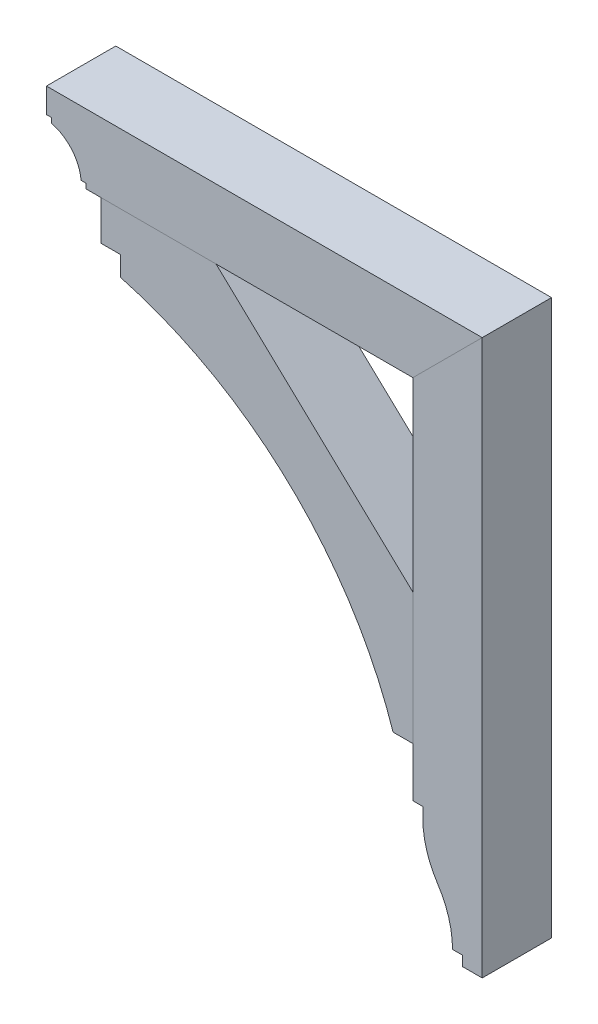
ISO-10303-21;
HEADER;
FILE_DESCRIPTION(('STEP AP214'),'2;1');
FILE_NAME('part.step','',(''),(''),'','','');
FILE_SCHEMA(('AUTOMOTIVE_DESIGN { 1 0 10303 214 1 1 1 1 }'));
ENDSEC;
DATA;
#1=APPLICATION_CONTEXT('core data for automotive mechanical design processes');
#2=APPLICATION_PROTOCOL_DEFINITION('international standard','automotive_design',2000,#1);
#3=PRODUCT_CONTEXT('',#1,'mechanical');
#4=PRODUCT('Part','Part','',(#3));
#5=PRODUCT_RELATED_PRODUCT_CATEGORY('part','',(#4));
#6=PRODUCT_DEFINITION_FORMATION('','',#4);
#7=PRODUCT_DEFINITION_CONTEXT('part definition',#1,'design');
#8=PRODUCT_DEFINITION('design','',#6,#7);
#9=PRODUCT_DEFINITION_SHAPE('','',#8);
#10=(LENGTH_UNIT() NAMED_UNIT(*) SI_UNIT(.MILLI.,.METRE.));
#11=(NAMED_UNIT(*) PLANE_ANGLE_UNIT() SI_UNIT($,.RADIAN.));
#12=(NAMED_UNIT(*) SI_UNIT($,.STERADIAN.) SOLID_ANGLE_UNIT());
#13=UNCERTAINTY_MEASURE_WITH_UNIT(LENGTH_MEASURE(1.E-05),#10,'distance_accuracy_value','');
#14=(GEOMETRIC_REPRESENTATION_CONTEXT(3) GLOBAL_UNCERTAINTY_ASSIGNED_CONTEXT((#13)) GLOBAL_UNIT_ASSIGNED_CONTEXT((#10,
#11,#12)) REPRESENTATION_CONTEXT('',''));
#15=CARTESIAN_POINT('',(0.,0.,0.));
#16=DIRECTION('',(0.,0.,1.));
#17=DIRECTION('',(1.,0.,0.));
#18=AXIS2_PLACEMENT_3D('',#15,#16,#17);
#19=CARTESIAN_POINT('',(246.881223015558,-2.15821431605898E-12,44.45));
#20=DIRECTION('',(1.,0.,0.));
#21=DIRECTION('',(0.,1.,0.));
#22=AXIS2_PLACEMENT_3D('',#19,#20,#21);
#23=PLANE('',#22);
#24=DIRECTION('',(0.,-1.,0.));
#25=VECTOR('',#24,1.);
#26=CARTESIAN_POINT('',(246.881223015558,-2.15821431605898E-12,-44.45));
#27=LINE('',#26,#25);
#28=CARTESIAN_POINT('',(246.881223015556,-183.515,-44.45));
#29=VERTEX_POINT('',#28);
#30=CARTESIAN_POINT('',(246.881223015556,-196.215,-44.45));
#31=VERTEX_POINT('',#30);
#32=EDGE_CURVE('E177',#29,#31,#27,.T.);
#33=ORIENTED_EDGE('',*,*,#32,.T.);
#34=DIRECTION('',(0.,0.,-1.));
#35=VECTOR('',#34,1.);
#36=CARTESIAN_POINT('',(246.881223015556,-196.215,44.45));
#37=LINE('',#36,#35);
#38=CARTESIAN_POINT('',(246.881223015556,-196.215,44.45));
#39=VERTEX_POINT('',#38);
#40=EDGE_CURVE('E12',#39,#31,#37,.T.);
#41=ORIENTED_EDGE('',*,*,#40,.F.);
#42=DIRECTION('',(0.,-1.,0.));
#43=VECTOR('',#42,1.);
#44=CARTESIAN_POINT('',(246.881223015558,-2.15821431605898E-12,44.45));
#45=LINE('',#44,#43);
#46=CARTESIAN_POINT('',(246.881223015556,-183.515,44.45));
#47=VERTEX_POINT('',#46);
#48=EDGE_CURVE('E209',#47,#39,#45,.T.);
#49=ORIENTED_EDGE('',*,*,#48,.F.);
#50=DIRECTION('',(0.,0.,-1.));
#51=VECTOR('',#50,1.);
#52=CARTESIAN_POINT('',(246.881223015556,-183.515,44.45));
#53=LINE('',#52,#51);
#54=EDGE_CURVE('E173',#47,#29,#53,.T.);
#55=ORIENTED_EDGE('',*,*,#54,.T.);
#56=EDGE_LOOP('',(#33,#41,#49,#55));
#57=FACE_BOUND('',#56,.T.);
#58=ADVANCED_FACE('F60',(#57),#23,.F.);
#59=CARTESIAN_POINT('',(362.768723015556,-196.215,44.45));
#60=DIRECTION('',(0.,0.,-1.));
#61=DIRECTION('',(-1.,0.,0.));
#62=AXIS2_PLACEMENT_3D('',#59,#60,#61);
#63=CYLINDRICAL_SURFACE('',#62,115.8875);
#64=CARTESIAN_POINT('',(362.768723015556,-196.215,-44.45));
#65=DIRECTION('',(0.,0.,1.));
#66=DIRECTION('',(1.,0.,0.));
#67=AXIS2_PLACEMENT_3D('',#64,#65,#66);
#68=CIRCLE('',#67,115.8875);
#69=CARTESIAN_POINT('',(266.018608336656,-260.006284403669,-44.45));
#70=VERTEX_POINT('',#69);
#71=EDGE_CURVE('E181',#31,#70,#68,.T.);
#72=ORIENTED_EDGE('',*,*,#71,.T.);
#73=DIRECTION('',(0.,0.,-1.));
#74=VECTOR('',#73,1.);
#75=CARTESIAN_POINT('',(266.018608336656,-260.006284403669,44.45));
#76=LINE('',#75,#74);
#77=CARTESIAN_POINT('',(266.018608336656,-260.006284403669,44.45));
#78=VERTEX_POINT('',#77);
#79=EDGE_CURVE('E69',#78,#70,#76,.T.);
#80=ORIENTED_EDGE('',*,*,#79,.F.);
#81=CARTESIAN_POINT('',(362.768723015556,-196.215,44.45));
#82=DIRECTION('',(0.,0.,1.));
#83=DIRECTION('',(1.,0.,0.));
#84=AXIS2_PLACEMENT_3D('',#81,#82,#83);
#85=CIRCLE('',#84,115.8875);
#86=EDGE_CURVE('E126',#39,#78,#85,.T.);
#87=ORIENTED_EDGE('',*,*,#86,.F.);
#88=ORIENTED_EDGE('',*,*,#40,.T.);
#89=EDGE_LOOP('',(#72,#80,#87,#88));
#90=FACE_BOUND('',#89,.T.);
#91=ADVANCED_FACE('F234',(#90),#63,.T.);
#92=CARTESIAN_POINT('',(170.152056348885,-323.215,44.45));
#93=DIRECTION('',(0.,0.,-1.));
#94=DIRECTION('',(-1.,0.,0.));
#95=AXIS2_PLACEMENT_3D('',#92,#93,#94);
#96=CYLINDRICAL_SURFACE('',#95,114.82916666667);
#97=CARTESIAN_POINT('',(170.152056348885,-323.215,-44.45));
#98=DIRECTION('',(0.,0.,1.));
#99=DIRECTION('',(1.,0.,0.));
#100=AXIS2_PLACEMENT_3D('',#97,#98,#99);
#101=CIRCLE('',#100,114.82916666667);
#102=CARTESIAN_POINT('',(284.981223015555,-323.215,-44.45));
#103=VERTEX_POINT('',#102);
#104=EDGE_CURVE('E185',#103,#70,#101,.T.);
#105=ORIENTED_EDGE('',*,*,#104,.F.);
#106=DIRECTION('',(0.,0.,-1.));
#107=VECTOR('',#106,1.);
#108=CARTESIAN_POINT('',(284.981223015555,-323.215,44.45));
#109=LINE('',#108,#107);
#110=CARTESIAN_POINT('',(284.981223015555,-323.215,44.45));
#111=VERTEX_POINT('',#110);
#112=EDGE_CURVE('E225',#111,#103,#109,.T.);
#113=ORIENTED_EDGE('',*,*,#112,.F.);
#114=CARTESIAN_POINT('',(170.152056348885,-323.215,44.45));
#115=DIRECTION('',(0.,0.,1.));
#116=DIRECTION('',(1.,0.,0.));
#117=AXIS2_PLACEMENT_3D('',#114,#115,#116);
#118=CIRCLE('',#117,114.82916666667);
#119=EDGE_CURVE('E233',#111,#78,#118,.T.);
#120=ORIENTED_EDGE('',*,*,#119,.T.);
#121=ORIENTED_EDGE('',*,*,#79,.T.);
#122=EDGE_LOOP('',(#105,#113,#120,#121));
#123=FACE_BOUND('',#122,.T.);
#124=ADVANCED_FACE('F231',(#123),#96,.F.);
#125=CARTESIAN_POINT('',(0.,-323.215,44.45));
#126=DIRECTION('',(0.,-1.,0.));
#127=DIRECTION('',(0.,0.,-1.));
#128=AXIS2_PLACEMENT_3D('',#125,#126,#127);
#129=PLANE('',#128);
#130=DIRECTION('',(-1.,0.,0.));
#131=VECTOR('',#130,1.);
#132=CARTESIAN_POINT('',(0.,-323.215,-44.45));
#133=LINE('',#132,#131);
#134=CARTESIAN_POINT('',(297.681223015555,-323.215,-44.45));
#135=VERTEX_POINT('',#134);
#136=EDGE_CURVE('E189',#135,#103,#133,.T.);
#137=ORIENTED_EDGE('',*,*,#136,.F.);
#138=DIRECTION('',(0.,0.,-1.));
#139=VECTOR('',#138,1.);
#140=CARTESIAN_POINT('',(297.681223015555,-323.215,44.45));
#141=LINE('',#140,#139);
#142=CARTESIAN_POINT('',(297.681223015555,-323.215,44.45));
#143=VERTEX_POINT('',#142);
#144=EDGE_CURVE('E222',#143,#135,#141,.T.);
#145=ORIENTED_EDGE('',*,*,#144,.F.);
#146=DIRECTION('',(-1.,0.,0.));
#147=VECTOR('',#146,1.);
#148=CARTESIAN_POINT('',(0.,-323.215,44.45));
#149=LINE('',#148,#147);
#150=EDGE_CURVE('E245',#143,#111,#149,.T.);
#151=ORIENTED_EDGE('',*,*,#150,.T.);
#152=ORIENTED_EDGE('',*,*,#112,.T.);
#153=EDGE_LOOP('',(#137,#145,#151,#152));
#154=FACE_BOUND('',#153,.T.);
#155=ADVANCED_FACE('F242',(#154),#129,.T.);
#156=CARTESIAN_POINT('',(297.681223015555,0.,44.45));
#157=DIRECTION('',(-1.,0.,0.));
#158=DIRECTION('',(0.,0.,1.));
#159=AXIS2_PLACEMENT_3D('',#156,#157,#158);
#160=PLANE('',#159);
#161=DIRECTION('',(0.,1.,0.));
#162=VECTOR('',#161,1.);
#163=CARTESIAN_POINT('',(297.681223015555,0.,-44.45));
#164=LINE('',#163,#162);
#165=CARTESIAN_POINT('',(297.681223015555,-335.915,-44.45));
#166=VERTEX_POINT('',#165);
#167=EDGE_CURVE('E193',#166,#135,#164,.T.);
#168=ORIENTED_EDGE('',*,*,#167,.F.);
#169=DIRECTION('',(0.,0.,-1.));
#170=VECTOR('',#169,1.);
#171=CARTESIAN_POINT('',(297.681223015555,-335.915,44.45));
#172=LINE('',#171,#170);
#173=CARTESIAN_POINT('',(297.681223015555,-335.915,44.45));
#174=VERTEX_POINT('',#173);
#175=EDGE_CURVE('E219',#174,#166,#172,.T.);
#176=ORIENTED_EDGE('',*,*,#175,.F.);
#177=DIRECTION('',(0.,1.,0.));
#178=VECTOR('',#177,1.);
#179=CARTESIAN_POINT('',(297.681223015555,0.,44.45));
#180=LINE('',#179,#178);
#181=EDGE_CURVE('E253',#174,#143,#180,.T.);
#182=ORIENTED_EDGE('',*,*,#181,.T.);
#183=ORIENTED_EDGE('',*,*,#144,.T.);
#184=EDGE_LOOP('',(#168,#176,#182,#183));
#185=FACE_BOUND('',#184,.T.);
#186=ADVANCED_FACE('F300',(#185),#160,.T.);
#187=CARTESIAN_POINT('',(7.34134975033387E-13,-335.915000000001,44.45));
#188=DIRECTION('',(0.,-1.,0.));
#189=DIRECTION('',(1.,0.,0.));
#190=AXIS2_PLACEMENT_3D('',#187,#188,#189);
#191=PLANE('',#190);
#192=DIRECTION('',(-1.,0.,0.));
#193=VECTOR('',#192,1.);
#194=CARTESIAN_POINT('',(7.34134975033387E-13,-335.915000000001,-44.45));
#195=LINE('',#194,#193);
#196=CARTESIAN_POINT('',(323.081223015555,-335.915,-44.45));
#197=VERTEX_POINT('',#196);
#198=EDGE_CURVE('E197',#197,#166,#195,.T.);
#199=ORIENTED_EDGE('',*,*,#198,.F.);
#200=DIRECTION('',(0.,0.,-1.));
#201=VECTOR('',#200,1.);
#202=CARTESIAN_POINT('',(323.081223015555,-335.915,44.45));
#203=LINE('',#202,#201);
#204=CARTESIAN_POINT('',(323.081223015555,-335.915,44.45));
#205=VERTEX_POINT('',#204);
#206=EDGE_CURVE('E216',#205,#197,#203,.T.);
#207=ORIENTED_EDGE('',*,*,#206,.F.);
#208=DIRECTION('',(-1.,0.,0.));
#209=VECTOR('',#208,1.);
#210=CARTESIAN_POINT('',(7.34134975033387E-13,-335.915000000001,44.45));
#211=LINE('',#210,#209);
#212=EDGE_CURVE('E261',#205,#174,#211,.T.);
#213=ORIENTED_EDGE('',*,*,#212,.T.);
#214=ORIENTED_EDGE('',*,*,#175,.T.);
#215=EDGE_LOOP('',(#199,#207,#213,#214));
#216=FACE_BOUND('',#215,.T.);
#217=ADVANCED_FACE('F298',(#216),#191,.T.);
#218=CARTESIAN_POINT('',(323.081223015555,0.,44.45));
#219=DIRECTION('',(-1.,0.,0.));
#220=DIRECTION('',(0.,0.,1.));
#221=AXIS2_PLACEMENT_3D('',#218,#219,#220);
#222=PLANE('',#221);
#223=DIRECTION('',(0.,1.,0.));
#224=VECTOR('',#223,1.);
#225=CARTESIAN_POINT('',(323.081223015555,0.,-44.45));
#226=LINE('',#225,#224);
#227=CARTESIAN_POINT('',(323.081223015555,375.285,-44.45));
#228=VERTEX_POINT('',#227);
#229=EDGE_CURVE('E201',#197,#228,#226,.T.);
#230=ORIENTED_EDGE('',*,*,#229,.T.);
#231=DIRECTION('',(0.,0.,-1.));
#232=VECTOR('',#231,1.);
#233=CARTESIAN_POINT('',(323.081223015555,375.285,44.45));
#234=LINE('',#233,#232);
#235=CARTESIAN_POINT('',(323.081223015555,375.285,44.45));
#236=VERTEX_POINT('',#235);
#237=EDGE_CURVE('E163',#236,#228,#234,.T.);
#238=ORIENTED_EDGE('',*,*,#237,.F.);
#239=DIRECTION('',(0.,1.,0.));
#240=VECTOR('',#239,1.);
#241=CARTESIAN_POINT('',(323.081223015555,0.,44.45));
#242=LINE('',#241,#240);
#243=EDGE_CURVE('E152',#205,#236,#242,.T.);
#244=ORIENTED_EDGE('',*,*,#243,.F.);
#245=ORIENTED_EDGE('',*,*,#206,.T.);
#246=EDGE_LOOP('',(#230,#238,#244,#245));
#247=FACE_BOUND('',#246,.T.);
#248=ADVANCED_FACE('F307',(#247),#222,.F.);
#249=CARTESIAN_POINT('',(-26.1018884922205,26.1018884922201,44.45));
#250=DIRECTION('',(0.707106781186552,-0.707106781186543,0.));
#251=DIRECTION('',(0.707106781186543,0.707106781186552,0.));
#252=AXIS2_PLACEMENT_3D('',#249,#250,#251);
#253=PLANE('',#252);
#254=DIRECTION('',(-0.707106781186543,-0.707106781186552,0.));
#255=VECTOR('',#254,1.);
#256=CARTESIAN_POINT('',(-26.1018884922205,26.1018884922201,-44.45));
#257=LINE('',#256,#255);
#258=CARTESIAN_POINT('',(234.181223015556,286.385,-44.45));
#259=VERTEX_POINT('',#258);
#260=EDGE_CURVE('E161',#228,#259,#257,.T.);
#261=ORIENTED_EDGE('',*,*,#260,.T.);
#262=DIRECTION('',(0.,0.,-1.));
#263=VECTOR('',#262,1.);
#264=CARTESIAN_POINT('',(234.181223015556,286.385,44.45));
#265=LINE('',#264,#263);
#266=CARTESIAN_POINT('',(234.181223015556,286.385,44.45));
#267=VERTEX_POINT('',#266);
#268=EDGE_CURVE('E158',#267,#259,#265,.T.);
#269=ORIENTED_EDGE('',*,*,#268,.F.);
#270=DIRECTION('',(-0.707106781186543,-0.707106781186552,0.));
#271=VECTOR('',#270,1.);
#272=CARTESIAN_POINT('',(-26.1018884922205,26.1018884922201,44.45));
#273=LINE('',#272,#271);
#274=EDGE_CURVE('E145',#236,#267,#273,.T.);
#275=ORIENTED_EDGE('',*,*,#274,.F.);
#276=ORIENTED_EDGE('',*,*,#237,.T.);
#277=EDGE_LOOP('',(#261,#269,#275,#276));
#278=FACE_BOUND('',#277,.T.);
#279=ADVANCED_FACE('F159',(#278),#253,.F.);
#280=CARTESIAN_POINT('',(234.181223015556,0.,44.45));
#281=DIRECTION('',(1.,0.,0.));
#282=DIRECTION('',(0.,1.,0.));
#283=AXIS2_PLACEMENT_3D('',#280,#281,#282);
#284=PLANE('',#283);
#285=DIRECTION('',(0.,-1.,0.));
#286=VECTOR('',#285,1.);
#287=CARTESIAN_POINT('',(234.181223015556,0.,-44.45));
#288=LINE('',#287,#286);
#289=CARTESIAN_POINT('',(234.181223015556,-183.515,-44.45));
#290=VERTEX_POINT('',#289);
#291=EDGE_CURVE('E112',#259,#290,#288,.T.);
#292=ORIENTED_EDGE('',*,*,#291,.T.);
#293=DIRECTION('',(0.,0.,-1.));
#294=VECTOR('',#293,1.);
#295=CARTESIAN_POINT('',(234.181223015556,-183.515,44.45));
#296=LINE('',#295,#294);
#297=CARTESIAN_POINT('',(234.181223015556,-183.515,44.45));
#298=VERTEX_POINT('',#297);
#299=EDGE_CURVE('E164',#298,#290,#296,.T.);
#300=ORIENTED_EDGE('',*,*,#299,.F.);
#301=DIRECTION('',(0.,-1.,0.));
#302=VECTOR('',#301,1.);
#303=CARTESIAN_POINT('',(234.181223015556,0.,44.45));
#304=LINE('',#303,#302);
#305=EDGE_CURVE('E149',#267,#298,#304,.T.);
#306=ORIENTED_EDGE('',*,*,#305,.F.);
#307=ORIENTED_EDGE('',*,*,#268,.T.);
#308=EDGE_LOOP('',(#292,#300,#306,#307));
#309=FACE_BOUND('',#308,.T.);
#310=ADVANCED_FACE('F166',(#309),#284,.F.);
#311=CARTESIAN_POINT('',(0.,-183.515,44.45));
#312=DIRECTION('',(0.,1.,0.));
#313=DIRECTION('',(0.,0.,1.));
#314=AXIS2_PLACEMENT_3D('',#311,#312,#313);
#315=PLANE('',#314);
#316=DIRECTION('',(1.,0.,0.));
#317=VECTOR('',#316,1.);
#318=CARTESIAN_POINT('',(0.,-183.515,-44.45));
#319=LINE('',#318,#317);
#320=EDGE_CURVE('E118',#290,#29,#319,.T.);
#321=ORIENTED_EDGE('',*,*,#320,.T.);
#322=ORIENTED_EDGE('',*,*,#54,.F.);
#323=DIRECTION('',(1.,0.,0.));
#324=VECTOR('',#323,1.);
#325=CARTESIAN_POINT('',(0.,-183.515,44.45));
#326=LINE('',#325,#324);
#327=EDGE_CURVE('E77',#298,#47,#326,.T.);
#328=ORIENTED_EDGE('',*,*,#327,.F.);
#329=ORIENTED_EDGE('',*,*,#299,.T.);
#330=EDGE_LOOP('',(#321,#322,#328,#329));
#331=FACE_BOUND('',#330,.T.);
#332=ADVANCED_FACE('F347',(#331),#315,.F.);
#333=CARTESIAN_POINT('',(0.,0.,44.45));
#334=DIRECTION('',(0.,0.,1.));
#335=DIRECTION('',(1.,0.,0.));
#336=AXIS2_PLACEMENT_3D('',#333,#334,#335);
#337=PLANE('',#336);
#338=ORIENTED_EDGE('',*,*,#48,.T.);
#339=ORIENTED_EDGE('',*,*,#86,.T.);
#340=ORIENTED_EDGE('',*,*,#119,.F.);
#341=ORIENTED_EDGE('',*,*,#150,.F.);
#342=ORIENTED_EDGE('',*,*,#181,.F.);
#343=ORIENTED_EDGE('',*,*,#212,.F.);
#344=ORIENTED_EDGE('',*,*,#243,.T.);
#345=ORIENTED_EDGE('',*,*,#274,.T.);
#346=ORIENTED_EDGE('',*,*,#305,.T.);
#347=ORIENTED_EDGE('',*,*,#327,.T.);
#348=EDGE_LOOP('',(#338,#339,#340,#341,#342,#343,#344,#345,#346,#347));
#349=FACE_BOUND('',#348,.T.);
#350=ADVANCED_FACE('F147',(#349),#337,.T.);
#351=CARTESIAN_POINT('',(0.,0.,-44.45));
#352=DIRECTION('',(0.,0.,1.));
#353=DIRECTION('',(1.,0.,0.));
#354=AXIS2_PLACEMENT_3D('',#351,#352,#353);
#355=PLANE('',#354);
#356=ORIENTED_EDGE('',*,*,#32,.F.);
#357=ORIENTED_EDGE('',*,*,#320,.F.);
#358=ORIENTED_EDGE('',*,*,#291,.F.);
#359=ORIENTED_EDGE('',*,*,#260,.F.);
#360=ORIENTED_EDGE('',*,*,#229,.F.);
#361=ORIENTED_EDGE('',*,*,#198,.T.);
#362=ORIENTED_EDGE('',*,*,#167,.T.);
#363=ORIENTED_EDGE('',*,*,#136,.T.);
#364=ORIENTED_EDGE('',*,*,#104,.T.);
#365=ORIENTED_EDGE('',*,*,#71,.F.);
#366=EDGE_LOOP('',(#356,#357,#358,#359,#360,#361,#362,#363,#364,#365));
#367=FACE_BOUND('',#366,.T.);
#368=ADVANCED_FACE('F238',(#367),#355,.F.);
#369=CLOSED_SHELL('',(#58,#91,#124,#155,#186,#217,#248,#279,#310,#332,#350,#368));
#370=MANIFOLD_SOLID_BREP('B2',#369);
#371=CARTESIAN_POINT('',(-140.468776984445,0.,44.45));
#372=DIRECTION('',(1.,0.,0.));
#373=DIRECTION('',(0.,0.,-1.));
#374=AXIS2_PLACEMENT_3D('',#371,#372,#373);
#375=PLANE('',#374);
#376=DIRECTION('',(0.,-1.,0.));
#377=VECTOR('',#376,1.);
#378=CARTESIAN_POINT('',(-140.468776984445,0.,-44.45));
#379=LINE('',#378,#377);
#380=CARTESIAN_POINT('',(-140.468776984445,235.585,-44.45));
#381=VERTEX_POINT('',#380);
#382=CARTESIAN_POINT('',(-140.468776984445,210.185,-44.45));
#383=VERTEX_POINT('',#382);
#384=EDGE_CURVE('E538',#381,#383,#379,.T.);
#385=ORIENTED_EDGE('',*,*,#384,.T.);
#386=DIRECTION('',(0.,0.,-1.));
#387=VECTOR('',#386,1.);
#388=CARTESIAN_POINT('',(-140.468776984445,210.185,44.45));
#389=LINE('',#388,#387);
#390=CARTESIAN_POINT('',(-140.468776984445,210.185,44.45));
#391=VERTEX_POINT('',#390);
#392=EDGE_CURVE('E58',#391,#383,#389,.T.);
#393=ORIENTED_EDGE('',*,*,#392,.F.);
#394=DIRECTION('',(0.,-1.,0.));
#395=VECTOR('',#394,1.);
#396=CARTESIAN_POINT('',(-140.468776984445,0.,44.45));
#397=LINE('',#396,#395);
#398=CARTESIAN_POINT('',(-140.468776984445,235.585,44.45));
#399=VERTEX_POINT('',#398);
#400=EDGE_CURVE('E563',#399,#391,#397,.T.);
#401=ORIENTED_EDGE('',*,*,#400,.F.);
#402=DIRECTION('',(0.,0.,-1.));
#403=VECTOR('',#402,1.);
#404=CARTESIAN_POINT('',(-140.468776984445,235.585,44.45));
#405=LINE('',#404,#403);
#406=EDGE_CURVE('E537',#399,#381,#405,.T.);
#407=ORIENTED_EDGE('',*,*,#406,.T.);
#408=EDGE_LOOP('',(#385,#393,#401,#407));
#409=FACE_BOUND('',#408,.T.);
#410=ADVANCED_FACE('F433',(#409),#375,.F.);
#411=CARTESIAN_POINT('',(-273.3242381875,-280.134718580156,44.45));
#412=DIRECTION('',(0.,0.,-1.));
#413=DIRECTION('',(-1.,0.,0.));
#414=AXIS2_PLACEMENT_3D('',#411,#412,#413);
#415=CYLINDRICAL_SURFACE('',#414,508.);
#416=CARTESIAN_POINT('',(-273.3242381875,-280.134718580156,-44.45));
#417=DIRECTION('',(0.,0.,1.));
#418=DIRECTION('',(1.,0.,0.));
#419=AXIS2_PLACEMENT_3D('',#416,#417,#418);
#420=CIRCLE('',#419,508.);
#421=CARTESIAN_POINT('',(208.781223015556,-120.015,-44.45));
#422=VERTEX_POINT('',#421);
#423=EDGE_CURVE('E542',#383,#422,#420,.F.);
#424=ORIENTED_EDGE('',*,*,#423,.T.);
#425=DIRECTION('',(0.,0.,-1.));
#426=VECTOR('',#425,1.);
#427=CARTESIAN_POINT('',(208.781223015556,-120.015,44.45));
#428=LINE('',#427,#426);
#429=CARTESIAN_POINT('',(208.781223015556,-120.015,44.45));
#430=VERTEX_POINT('',#429);
#431=EDGE_CURVE('E442',#430,#422,#428,.T.);
#432=ORIENTED_EDGE('',*,*,#431,.F.);
#433=CARTESIAN_POINT('',(-273.3242381875,-280.134718580156,44.45));
#434=DIRECTION('',(0.,0.,1.));
#435=DIRECTION('',(1.,0.,0.));
#436=AXIS2_PLACEMENT_3D('',#433,#434,#435);
#437=CIRCLE('',#436,508.);
#438=EDGE_CURVE('E492',#391,#430,#437,.F.);
#439=ORIENTED_EDGE('',*,*,#438,.F.);
#440=ORIENTED_EDGE('',*,*,#392,.T.);
#441=EDGE_LOOP('',(#424,#432,#439,#440));
#442=FACE_BOUND('',#441,.T.);
#443=ADVANCED_FACE('F583',(#442),#415,.F.);
#444=CARTESIAN_POINT('',(0.,-120.015,44.45));
#445=DIRECTION('',(0.,-1.,0.));
#446=DIRECTION('',(1.,0.,0.));
#447=AXIS2_PLACEMENT_3D('',#444,#445,#446);
#448=PLANE('',#447);
#449=DIRECTION('',(-1.,0.,0.));
#450=VECTOR('',#449,1.);
#451=CARTESIAN_POINT('',(0.,-120.015,-44.45));
#452=LINE('',#451,#450);
#453=CARTESIAN_POINT('',(234.181223015556,-120.015,-44.45));
#454=VERTEX_POINT('',#453);
#455=EDGE_CURVE('E545',#454,#422,#452,.T.);
#456=ORIENTED_EDGE('',*,*,#455,.F.);
#457=DIRECTION('',(0.,0.,-1.));
#458=VECTOR('',#457,1.);
#459=CARTESIAN_POINT('',(234.181223015556,-120.015,44.45));
#460=LINE('',#459,#458);
#461=CARTESIAN_POINT('',(234.181223015556,-120.015,44.45));
#462=VERTEX_POINT('',#461);
#463=EDGE_CURVE('E573',#462,#454,#460,.T.);
#464=ORIENTED_EDGE('',*,*,#463,.F.);
#465=DIRECTION('',(-1.,0.,0.));
#466=VECTOR('',#465,1.);
#467=CARTESIAN_POINT('',(0.,-120.015,44.45));
#468=LINE('',#467,#466);
#469=EDGE_CURVE('E582',#462,#430,#468,.T.);
#470=ORIENTED_EDGE('',*,*,#469,.T.);
#471=ORIENTED_EDGE('',*,*,#431,.T.);
#472=EDGE_LOOP('',(#456,#464,#470,#471));
#473=FACE_BOUND('',#472,.T.);
#474=ADVANCED_FACE('F580',(#473),#448,.T.);
#475=CARTESIAN_POINT('',(234.181223015556,0.,44.45));
#476=DIRECTION('',(1.,0.,0.));
#477=DIRECTION('',(0.,1.,0.));
#478=AXIS2_PLACEMENT_3D('',#475,#476,#477);
#479=PLANE('',#478);
#480=DIRECTION('',(0.,-1.,0.));
#481=VECTOR('',#480,1.);
#482=CARTESIAN_POINT('',(234.181223015556,0.,-44.45));
#483=LINE('',#482,#481);
#484=CARTESIAN_POINT('',(234.181223015556,48.2599999999997,-44.45));
#485=VERTEX_POINT('',#484);
#486=EDGE_CURVE('E549',#485,#454,#483,.T.);
#487=ORIENTED_EDGE('',*,*,#486,.F.);
#488=DIRECTION('',(0.,0.,-1.));
#489=VECTOR('',#488,1.);
#490=CARTESIAN_POINT('',(234.181223015556,48.2599999999997,44.45));
#491=LINE('',#490,#489);
#492=CARTESIAN_POINT('',(234.181223015556,48.2599999999997,44.45));
#493=VERTEX_POINT('',#492);
#494=EDGE_CURVE('E570',#493,#485,#491,.T.);
#495=ORIENTED_EDGE('',*,*,#494,.F.);
#496=DIRECTION('',(0.,-1.,0.));
#497=VECTOR('',#496,1.);
#498=CARTESIAN_POINT('',(234.181223015556,0.,44.45));
#499=LINE('',#498,#497);
#500=EDGE_CURVE('E532',#493,#462,#499,.T.);
#501=ORIENTED_EDGE('',*,*,#500,.T.);
#502=ORIENTED_EDGE('',*,*,#463,.T.);
#503=EDGE_LOOP('',(#487,#495,#501,#502));
#504=FACE_BOUND('',#503,.T.);
#505=ADVANCED_FACE('F591',(#504),#479,.T.);
#506=CARTESIAN_POINT('',(134.364674616479,142.426555093468,44.45));
#507=DIRECTION('',(0.686220426895719,0.727393652509462,0.));
#508=DIRECTION('',(-0.727393652509462,0.686220426895719,0.));
#509=AXIS2_PLACEMENT_3D('',#506,#507,#508);
#510=PLANE('',#509);
#511=DIRECTION('',(0.727393652509463,-0.686220426895719,0.));
#512=VECTOR('',#511,1.);
#513=CARTESIAN_POINT('',(134.364674616479,142.426555093468,-44.45));
#514=LINE('',#513,#512);
#515=CARTESIAN_POINT('',(-18.2312769844441,286.385,-44.45));
#516=VERTEX_POINT('',#515);
#517=EDGE_CURVE('E553',#516,#485,#514,.T.);
#518=ORIENTED_EDGE('',*,*,#517,.F.);
#519=DIRECTION('',(0.,0.,-1.));
#520=VECTOR('',#519,1.);
#521=CARTESIAN_POINT('',(-18.2312769844441,286.385,44.45));
#522=LINE('',#521,#520);
#523=CARTESIAN_POINT('',(-18.2312769844441,286.385,44.45));
#524=VERTEX_POINT('',#523);
#525=EDGE_CURVE('E515',#524,#516,#522,.T.);
#526=ORIENTED_EDGE('',*,*,#525,.F.);
#527=DIRECTION('',(0.727393652509463,-0.686220426895719,0.));
#528=VECTOR('',#527,1.);
#529=CARTESIAN_POINT('',(134.364674616479,142.426555093468,44.45));
#530=LINE('',#529,#528);
#531=EDGE_CURVE('E526',#524,#493,#530,.T.);
#532=ORIENTED_EDGE('',*,*,#531,.T.);
#533=ORIENTED_EDGE('',*,*,#494,.T.);
#534=EDGE_LOOP('',(#518,#526,#532,#533));
#535=FACE_BOUND('',#534,.T.);
#536=ADVANCED_FACE('F622',(#535),#510,.T.);
#537=CARTESIAN_POINT('',(0.,286.385,44.45));
#538=DIRECTION('',(0.,1.,0.));
#539=DIRECTION('',(0.,0.,1.));
#540=AXIS2_PLACEMENT_3D('',#537,#538,#539);
#541=PLANE('',#540);
#542=DIRECTION('',(1.,0.,0.));
#543=VECTOR('',#542,1.);
#544=CARTESIAN_POINT('',(0.,286.385,-44.45));
#545=LINE('',#544,#543);
#546=CARTESIAN_POINT('',(-165.868776984445,286.385,-44.45));
#547=VERTEX_POINT('',#546);
#548=EDGE_CURVE('E513',#547,#516,#545,.T.);
#549=ORIENTED_EDGE('',*,*,#548,.F.);
#550=DIRECTION('',(0.,0.,-1.));
#551=VECTOR('',#550,1.);
#552=CARTESIAN_POINT('',(-165.868776984445,286.385,44.45));
#553=LINE('',#552,#551);
#554=CARTESIAN_POINT('',(-165.868776984445,286.385,44.45));
#555=VERTEX_POINT('',#554);
#556=EDGE_CURVE('E507',#555,#547,#553,.T.);
#557=ORIENTED_EDGE('',*,*,#556,.F.);
#558=DIRECTION('',(1.,0.,0.));
#559=VECTOR('',#558,1.);
#560=CARTESIAN_POINT('',(0.,286.385,44.45));
#561=LINE('',#560,#559);
#562=EDGE_CURVE('E511',#555,#524,#561,.T.);
#563=ORIENTED_EDGE('',*,*,#562,.T.);
#564=ORIENTED_EDGE('',*,*,#525,.T.);
#565=EDGE_LOOP('',(#549,#557,#563,#564));
#566=FACE_BOUND('',#565,.T.);
#567=ADVANCED_FACE('F509',(#566),#541,.T.);
#568=CARTESIAN_POINT('',(-165.868776984445,0.,44.45));
#569=DIRECTION('',(1.,0.,0.));
#570=DIRECTION('',(0.,0.,-1.));
#571=AXIS2_PLACEMENT_3D('',#568,#569,#570);
#572=PLANE('',#571);
#573=DIRECTION('',(0.,-1.,0.));
#574=VECTOR('',#573,1.);
#575=CARTESIAN_POINT('',(-165.868776984445,0.,-44.45));
#576=LINE('',#575,#574);
#577=CARTESIAN_POINT('',(-165.868776984445,235.585,-44.45));
#578=VERTEX_POINT('',#577);
#579=EDGE_CURVE('E478',#547,#578,#576,.T.);
#580=ORIENTED_EDGE('',*,*,#579,.T.);
#581=DIRECTION('',(0.,0.,-1.));
#582=VECTOR('',#581,1.);
#583=CARTESIAN_POINT('',(-165.868776984445,235.585,44.45));
#584=LINE('',#583,#582);
#585=CARTESIAN_POINT('',(-165.868776984445,235.585,44.45));
#586=VERTEX_POINT('',#585);
#587=EDGE_CURVE('E516',#586,#578,#584,.T.);
#588=ORIENTED_EDGE('',*,*,#587,.F.);
#589=DIRECTION('',(0.,-1.,0.));
#590=VECTOR('',#589,1.);
#591=CARTESIAN_POINT('',(-165.868776984445,0.,44.45));
#592=LINE('',#591,#590);
#593=EDGE_CURVE('E518',#555,#586,#592,.T.);
#594=ORIENTED_EDGE('',*,*,#593,.F.);
#595=ORIENTED_EDGE('',*,*,#556,.T.);
#596=EDGE_LOOP('',(#580,#588,#594,#595));
#597=FACE_BOUND('',#596,.T.);
#598=ADVANCED_FACE('F519',(#597),#572,.F.);
#599=CARTESIAN_POINT('',(0.,235.585,44.45));
#600=DIRECTION('',(0.,1.,0.));
#601=DIRECTION('',(0.,0.,1.));
#602=AXIS2_PLACEMENT_3D('',#599,#600,#601);
#603=PLANE('',#602);
#604=DIRECTION('',(1.,0.,0.));
#605=VECTOR('',#604,1.);
#606=CARTESIAN_POINT('',(0.,235.585,-44.45));
#607=LINE('',#606,#605);
#608=EDGE_CURVE('E484',#578,#381,#607,.T.);
#609=ORIENTED_EDGE('',*,*,#608,.T.);
#610=ORIENTED_EDGE('',*,*,#406,.F.);
#611=DIRECTION('',(1.,0.,0.));
#612=VECTOR('',#611,1.);
#613=CARTESIAN_POINT('',(0.,235.585,44.45));
#614=LINE('',#613,#612);
#615=EDGE_CURVE('E450',#586,#399,#614,.T.);
#616=ORIENTED_EDGE('',*,*,#615,.F.);
#617=ORIENTED_EDGE('',*,*,#587,.T.);
#618=EDGE_LOOP('',(#609,#610,#616,#617));
#619=FACE_BOUND('',#618,.T.);
#620=ADVANCED_FACE('F601',(#619),#603,.F.);
#621=CARTESIAN_POINT('',(0.,0.,44.45));
#622=DIRECTION('',(0.,0.,1.));
#623=DIRECTION('',(1.,0.,0.));
#624=AXIS2_PLACEMENT_3D('',#621,#622,#623);
#625=PLANE('',#624);
#626=ORIENTED_EDGE('',*,*,#400,.T.);
#627=ORIENTED_EDGE('',*,*,#438,.T.);
#628=ORIENTED_EDGE('',*,*,#469,.F.);
#629=ORIENTED_EDGE('',*,*,#500,.F.);
#630=ORIENTED_EDGE('',*,*,#531,.F.);
#631=ORIENTED_EDGE('',*,*,#562,.F.);
#632=ORIENTED_EDGE('',*,*,#593,.T.);
#633=ORIENTED_EDGE('',*,*,#615,.T.);
#634=EDGE_LOOP('',(#626,#627,#628,#629,#630,#631,#632,#633));
#635=FACE_BOUND('',#634,.T.);
#636=ADVANCED_FACE('F523',(#635),#625,.T.);
#637=CARTESIAN_POINT('',(0.,0.,-44.45));
#638=DIRECTION('',(0.,0.,1.));
#639=DIRECTION('',(1.,0.,0.));
#640=AXIS2_PLACEMENT_3D('',#637,#638,#639);
#641=PLANE('',#640);
#642=ORIENTED_EDGE('',*,*,#384,.F.);
#643=ORIENTED_EDGE('',*,*,#608,.F.);
#644=ORIENTED_EDGE('',*,*,#579,.F.);
#645=ORIENTED_EDGE('',*,*,#548,.T.);
#646=ORIENTED_EDGE('',*,*,#517,.T.);
#647=ORIENTED_EDGE('',*,*,#486,.T.);
#648=ORIENTED_EDGE('',*,*,#455,.T.);
#649=ORIENTED_EDGE('',*,*,#423,.F.);
#650=EDGE_LOOP('',(#642,#643,#644,#645,#646,#647,#648,#649));
#651=FACE_BOUND('',#650,.T.);
#652=ADVANCED_FACE('F587',(#651),#641,.F.);
#653=CLOSED_SHELL('',(#410,#443,#474,#505,#536,#567,#598,#620,#636,#652));
#654=MANIFOLD_SOLID_BREP('B6',#653);
#655=CARTESIAN_POINT('',(-229.368776984445,0.,44.45));
#656=DIRECTION('',(-1.,0.,0.));
#657=DIRECTION('',(0.,0.,1.));
#658=AXIS2_PLACEMENT_3D('',#655,#656,#657);
#659=PLANE('',#658);
#660=DIRECTION('',(0.,1.,0.));
#661=VECTOR('',#660,1.);
#662=CARTESIAN_POINT('',(-229.368776984445,0.,-44.45));
#663=LINE('',#662,#661);
#664=CARTESIAN_POINT('',(-229.368776984445,337.185,-44.45));
#665=VERTEX_POINT('',#664);
#666=CARTESIAN_POINT('',(-229.368776984445,343.535,-44.45));
#667=VERTEX_POINT('',#666);
#668=EDGE_CURVE('E810',#665,#667,#663,.T.);
#669=ORIENTED_EDGE('',*,*,#668,.F.);
#670=DIRECTION('',(0.,0.,-1.));
#671=VECTOR('',#670,1.);
#672=CARTESIAN_POINT('',(-229.368776984445,337.185,44.45));
#673=LINE('',#672,#671);
#674=CARTESIAN_POINT('',(-229.368776984445,337.185,44.45));
#675=VERTEX_POINT('',#674);
#676=EDGE_CURVE('E431',#675,#665,#673,.T.);
#677=ORIENTED_EDGE('',*,*,#676,.F.);
#678=DIRECTION('',(0.,1.,0.));
#679=VECTOR('',#678,1.);
#680=CARTESIAN_POINT('',(-229.368776984445,0.,44.45));
#681=LINE('',#680,#679);
#682=CARTESIAN_POINT('',(-229.368776984445,343.535,44.45));
#683=VERTEX_POINT('',#682);
#684=EDGE_CURVE('E842',#675,#683,#681,.T.);
#685=ORIENTED_EDGE('',*,*,#684,.T.);
#686=DIRECTION('',(0.,0.,-1.));
#687=VECTOR('',#686,1.);
#688=CARTESIAN_POINT('',(-229.368776984445,343.535,44.45));
#689=LINE('',#688,#687);
#690=EDGE_CURVE('E722',#683,#667,#689,.T.);
#691=ORIENTED_EDGE('',*,*,#690,.T.);
#692=EDGE_LOOP('',(#669,#677,#685,#691));
#693=FACE_BOUND('',#692,.T.);
#694=ADVANCED_FACE('F705',(#693),#659,.T.);
#695=CARTESIAN_POINT('',(-241.780101736884,287.993150212195,44.45));
#696=DIRECTION('',(0.,0.,-1.));
#697=DIRECTION('',(-1.,0.,0.));
#698=AXIS2_PLACEMENT_3D('',#695,#696,#697);
#699=CYLINDRICAL_SURFACE('',#698,50.7334117486338);
#700=CARTESIAN_POINT('',(-241.780101736884,287.993150212195,-44.45));
#701=DIRECTION('',(0.,0.,1.));
#702=DIRECTION('',(1.,0.,0.));
#703=AXIS2_PLACEMENT_3D('',#700,#701,#702);
#704=CIRCLE('',#703,50.7334117486338);
#705=CARTESIAN_POINT('',(-191.268776984445,292.735,-44.45));
#706=VERTEX_POINT('',#705);
#707=EDGE_CURVE('E813',#665,#706,#704,.F.);
#708=ORIENTED_EDGE('',*,*,#707,.T.);
#709=DIRECTION('',(0.,0.,-1.));
#710=VECTOR('',#709,1.);
#711=CARTESIAN_POINT('',(-191.268776984445,292.735,44.45));
#712=LINE('',#711,#710);
#713=CARTESIAN_POINT('',(-191.268776984445,292.735,44.45));
#714=VERTEX_POINT('',#713);
#715=EDGE_CURVE('E714',#714,#706,#712,.T.);
#716=ORIENTED_EDGE('',*,*,#715,.F.);
#717=CARTESIAN_POINT('',(-241.780101736884,287.993150212195,44.45));
#718=DIRECTION('',(0.,0.,1.));
#719=DIRECTION('',(1.,0.,0.));
#720=AXIS2_PLACEMENT_3D('',#717,#718,#719);
#721=CIRCLE('',#720,50.7334117486338);
#722=EDGE_CURVE('E878',#675,#714,#721,.F.);
#723=ORIENTED_EDGE('',*,*,#722,.F.);
#724=ORIENTED_EDGE('',*,*,#676,.T.);
#725=EDGE_LOOP('',(#708,#716,#723,#724));
#726=FACE_BOUND('',#725,.T.);
#727=ADVANCED_FACE('F867',(#726),#699,.F.);
#728=CARTESIAN_POINT('',(0.,292.735,44.45));
#729=DIRECTION('',(0.,-1.,0.));
#730=DIRECTION('',(0.,0.,-1.));
#731=AXIS2_PLACEMENT_3D('',#728,#729,#730);
#732=PLANE('',#731);
#733=DIRECTION('',(-1.,0.,0.));
#734=VECTOR('',#733,1.);
#735=CARTESIAN_POINT('',(0.,292.735,-44.45));
#736=LINE('',#735,#734);
#737=CARTESIAN_POINT('',(-184.918776984445,292.735,-44.45));
#738=VERTEX_POINT('',#737);
#739=EDGE_CURVE('E817',#738,#706,#736,.T.);
#740=ORIENTED_EDGE('',*,*,#739,.F.);
#741=DIRECTION('',(0.,0.,-1.));
#742=VECTOR('',#741,1.);
#743=CARTESIAN_POINT('',(-184.918776984445,292.735,44.45));
#744=LINE('',#743,#742);
#745=CARTESIAN_POINT('',(-184.918776984445,292.735,44.45));
#746=VERTEX_POINT('',#745);
#747=EDGE_CURVE('E855',#746,#738,#744,.T.);
#748=ORIENTED_EDGE('',*,*,#747,.F.);
#749=DIRECTION('',(-1.,0.,0.));
#750=VECTOR('',#749,1.);
#751=CARTESIAN_POINT('',(0.,292.735,44.45));
#752=LINE('',#751,#750);
#753=EDGE_CURVE('E864',#746,#714,#752,.T.);
#754=ORIENTED_EDGE('',*,*,#753,.T.);
#755=ORIENTED_EDGE('',*,*,#715,.T.);
#756=EDGE_LOOP('',(#740,#748,#754,#755));
#757=FACE_BOUND('',#756,.T.);
#758=ADVANCED_FACE('F862',(#757),#732,.T.);
#759=CARTESIAN_POINT('',(-184.918776984445,0.,44.45));
#760=DIRECTION('',(-1.,0.,0.));
#761=DIRECTION('',(0.,0.,1.));
#762=AXIS2_PLACEMENT_3D('',#759,#760,#761);
#763=PLANE('',#762);
#764=DIRECTION('',(0.,1.,0.));
#765=VECTOR('',#764,1.);
#766=CARTESIAN_POINT('',(-184.918776984445,0.,-44.45));
#767=LINE('',#766,#765);
#768=CARTESIAN_POINT('',(-184.918776984445,286.385,-44.45));
#769=VERTEX_POINT('',#768);
#770=EDGE_CURVE('E821',#769,#738,#767,.T.);
#771=ORIENTED_EDGE('',*,*,#770,.F.);
#772=DIRECTION('',(0.,0.,-1.));
#773=VECTOR('',#772,1.);
#774=CARTESIAN_POINT('',(-184.918776984445,286.385,44.45));
#775=LINE('',#774,#773);
#776=CARTESIAN_POINT('',(-184.918776984445,286.385,44.45));
#777=VERTEX_POINT('',#776);
#778=EDGE_CURVE('E852',#777,#769,#775,.T.);
#779=ORIENTED_EDGE('',*,*,#778,.F.);
#780=DIRECTION('',(0.,1.,0.));
#781=VECTOR('',#780,1.);
#782=CARTESIAN_POINT('',(-184.918776984445,0.,44.45));
#783=LINE('',#782,#781);
#784=EDGE_CURVE('E877',#777,#746,#783,.T.);
#785=ORIENTED_EDGE('',*,*,#784,.T.);
#786=ORIENTED_EDGE('',*,*,#747,.T.);
#787=EDGE_LOOP('',(#771,#779,#785,#786));
#788=FACE_BOUND('',#787,.T.);
#789=ADVANCED_FACE('F873',(#788),#763,.T.);
#790=CARTESIAN_POINT('',(0.,286.385,44.45));
#791=DIRECTION('',(0.,1.,0.));
#792=DIRECTION('',(0.,0.,1.));
#793=AXIS2_PLACEMENT_3D('',#790,#791,#792);
#794=PLANE('',#793);
#795=DIRECTION('',(1.,0.,0.));
#796=VECTOR('',#795,1.);
#797=CARTESIAN_POINT('',(0.,286.385,-44.45));
#798=LINE('',#797,#796);
#799=CARTESIAN_POINT('',(234.181223015556,286.385,-44.45));
#800=VERTEX_POINT('',#799);
#801=EDGE_CURVE('E825',#769,#800,#798,.T.);
#802=ORIENTED_EDGE('',*,*,#801,.T.);
#803=DIRECTION('',(0.,0.,-1.));
#804=VECTOR('',#803,1.);
#805=CARTESIAN_POINT('',(234.181223015556,286.385,44.45));
#806=LINE('',#805,#804);
#807=CARTESIAN_POINT('',(234.181223015556,286.385,44.45));
#808=VERTEX_POINT('',#807);
#809=EDGE_CURVE('E849',#808,#800,#806,.T.);
#810=ORIENTED_EDGE('',*,*,#809,.F.);
#811=DIRECTION('',(1.,0.,0.));
#812=VECTOR('',#811,1.);
#813=CARTESIAN_POINT('',(0.,286.385,44.45));
#814=LINE('',#813,#812);
#815=EDGE_CURVE('E882',#777,#808,#814,.T.);
#816=ORIENTED_EDGE('',*,*,#815,.F.);
#817=ORIENTED_EDGE('',*,*,#778,.T.);
#818=EDGE_LOOP('',(#802,#810,#816,#817));
#819=FACE_BOUND('',#818,.T.);
#820=ADVANCED_FACE('F914',(#819),#794,.F.);
#821=CARTESIAN_POINT('',(-26.1018884922205,26.1018884922201,44.45));
#822=DIRECTION('',(0.707106781186552,-0.707106781186543,0.));
#823=DIRECTION('',(0.707106781186543,0.707106781186552,0.));
#824=AXIS2_PLACEMENT_3D('',#821,#822,#823);
#825=PLANE('',#824);
#826=DIRECTION('',(-0.707106781186543,-0.707106781186552,0.));
#827=VECTOR('',#826,1.);
#828=CARTESIAN_POINT('',(-26.1018884922205,26.1018884922201,-44.45));
#829=LINE('',#828,#827);
#830=CARTESIAN_POINT('',(323.081223015555,375.285,-44.45));
#831=VERTEX_POINT('',#830);
#832=EDGE_CURVE('E829',#831,#800,#829,.T.);
#833=ORIENTED_EDGE('',*,*,#832,.F.);
#834=DIRECTION('',(0.,0.,-1.));
#835=VECTOR('',#834,1.);
#836=CARTESIAN_POINT('',(323.081223015555,375.285,44.45));
#837=LINE('',#836,#835);
#838=CARTESIAN_POINT('',(323.081223015555,375.285,44.45));
#839=VERTEX_POINT('',#838);
#840=EDGE_CURVE('E799',#839,#831,#837,.T.);
#841=ORIENTED_EDGE('',*,*,#840,.F.);
#842=DIRECTION('',(-0.707106781186543,-0.707106781186552,0.));
#843=VECTOR('',#842,1.);
#844=CARTESIAN_POINT('',(-26.1018884922205,26.1018884922201,44.45));
#845=LINE('',#844,#843);
#846=EDGE_CURVE('E787',#839,#808,#845,.T.);
#847=ORIENTED_EDGE('',*,*,#846,.T.);
#848=ORIENTED_EDGE('',*,*,#809,.T.);
#849=EDGE_LOOP('',(#833,#841,#847,#848));
#850=FACE_BOUND('',#849,.T.);
#851=ADVANCED_FACE('F891',(#850),#825,.T.);
#852=CARTESIAN_POINT('',(0.,375.285,44.45));
#853=DIRECTION('',(0.,-1.,0.));
#854=DIRECTION('',(0.,0.,-1.));
#855=AXIS2_PLACEMENT_3D('',#852,#853,#854);
#856=PLANE('',#855);
#857=DIRECTION('',(-1.,0.,0.));
#858=VECTOR('',#857,1.);
#859=CARTESIAN_POINT('',(0.,375.285,-44.45));
#860=LINE('',#859,#858);
#861=CARTESIAN_POINT('',(-235.718776984445,375.285,-44.45));
#862=VERTEX_POINT('',#861);
#863=EDGE_CURVE('E795',#831,#862,#860,.T.);
#864=ORIENTED_EDGE('',*,*,#863,.T.);
#865=DIRECTION('',(0.,0.,-1.));
#866=VECTOR('',#865,1.);
#867=CARTESIAN_POINT('',(-235.718776984445,375.285,44.45));
#868=LINE('',#867,#866);
#869=CARTESIAN_POINT('',(-235.718776984445,375.285,44.45));
#870=VERTEX_POINT('',#869);
#871=EDGE_CURVE('E792',#870,#862,#868,.T.);
#872=ORIENTED_EDGE('',*,*,#871,.F.);
#873=DIRECTION('',(-1.,0.,0.));
#874=VECTOR('',#873,1.);
#875=CARTESIAN_POINT('',(0.,375.285,44.45));
#876=LINE('',#875,#874);
#877=EDGE_CURVE('E779',#839,#870,#876,.T.);
#878=ORIENTED_EDGE('',*,*,#877,.F.);
#879=ORIENTED_EDGE('',*,*,#840,.T.);
#880=EDGE_LOOP('',(#864,#872,#878,#879));
#881=FACE_BOUND('',#880,.T.);
#882=ADVANCED_FACE('F793',(#881),#856,.F.);
#883=CARTESIAN_POINT('',(-235.718776984445,-2.06063317751664E-13,44.45));
#884=DIRECTION('',(1.,0.,0.));
#885=DIRECTION('',(0.,1.,0.));
#886=AXIS2_PLACEMENT_3D('',#883,#884,#885);
#887=PLANE('',#886);
#888=DIRECTION('',(0.,-1.,0.));
#889=VECTOR('',#888,1.);
#890=CARTESIAN_POINT('',(-235.718776984445,-2.06063317751664E-13,-44.45));
#891=LINE('',#890,#889);
#892=CARTESIAN_POINT('',(-235.718776984445,343.535,-44.45));
#893=VERTEX_POINT('',#892);
#894=EDGE_CURVE('E835',#862,#893,#891,.T.);
#895=ORIENTED_EDGE('',*,*,#894,.T.);
#896=DIRECTION('',(0.,0.,-1.));
#897=VECTOR('',#896,1.);
#898=CARTESIAN_POINT('',(-235.718776984445,343.535,44.45));
#899=LINE('',#898,#897);
#900=CARTESIAN_POINT('',(-235.718776984445,343.535,44.45));
#901=VERTEX_POINT('',#900);
#902=EDGE_CURVE('E751',#901,#893,#899,.T.);
#903=ORIENTED_EDGE('',*,*,#902,.F.);
#904=DIRECTION('',(0.,-1.,0.));
#905=VECTOR('',#904,1.);
#906=CARTESIAN_POINT('',(-235.718776984445,-2.06063317751664E-13,44.45));
#907=LINE('',#906,#905);
#908=EDGE_CURVE('E785',#870,#901,#907,.T.);
#909=ORIENTED_EDGE('',*,*,#908,.F.);
#910=ORIENTED_EDGE('',*,*,#871,.T.);
#911=EDGE_LOOP('',(#895,#903,#909,#910));
#912=FACE_BOUND('',#911,.T.);
#913=ADVANCED_FACE('F801',(#912),#887,.F.);
#914=CARTESIAN_POINT('',(0.,343.535,44.45));
#915=DIRECTION('',(0.,-1.,0.));
#916=DIRECTION('',(0.,0.,-1.));
#917=AXIS2_PLACEMENT_3D('',#914,#915,#916);
#918=PLANE('',#917);
#919=DIRECTION('',(-1.,0.,0.));
#920=VECTOR('',#919,1.);
#921=CARTESIAN_POINT('',(0.,343.535,-44.45));
#922=LINE('',#921,#920);
#923=EDGE_CURVE('E838',#667,#893,#922,.T.);
#924=ORIENTED_EDGE('',*,*,#923,.F.);
#925=ORIENTED_EDGE('',*,*,#690,.F.);
#926=DIRECTION('',(-1.,0.,0.));
#927=VECTOR('',#926,1.);
#928=CARTESIAN_POINT('',(0.,343.535,44.45));
#929=LINE('',#928,#927);
#930=EDGE_CURVE('E803',#683,#901,#929,.T.);
#931=ORIENTED_EDGE('',*,*,#930,.T.);
#932=ORIENTED_EDGE('',*,*,#902,.T.);
#933=EDGE_LOOP('',(#924,#925,#931,#932));
#934=FACE_BOUND('',#933,.T.);
#935=ADVANCED_FACE('F893',(#934),#918,.T.);
#936=CARTESIAN_POINT('',(0.,0.,44.45));
#937=DIRECTION('',(0.,0.,1.));
#938=DIRECTION('',(1.,0.,0.));
#939=AXIS2_PLACEMENT_3D('',#936,#937,#938);
#940=PLANE('',#939);
#941=ORIENTED_EDGE('',*,*,#684,.F.);
#942=ORIENTED_EDGE('',*,*,#722,.T.);
#943=ORIENTED_EDGE('',*,*,#753,.F.);
#944=ORIENTED_EDGE('',*,*,#784,.F.);
#945=ORIENTED_EDGE('',*,*,#815,.T.);
#946=ORIENTED_EDGE('',*,*,#846,.F.);
#947=ORIENTED_EDGE('',*,*,#877,.T.);
#948=ORIENTED_EDGE('',*,*,#908,.T.);
#949=ORIENTED_EDGE('',*,*,#930,.F.);
#950=EDGE_LOOP('',(#941,#942,#943,#944,#945,#946,#947,#948,#949));
#951=FACE_BOUND('',#950,.T.);
#952=ADVANCED_FACE('F782',(#951),#940,.T.);
#953=CARTESIAN_POINT('',(0.,0.,-44.45));
#954=DIRECTION('',(0.,0.,1.));
#955=DIRECTION('',(1.,0.,0.));
#956=AXIS2_PLACEMENT_3D('',#953,#954,#955);
#957=PLANE('',#956);
#958=ORIENTED_EDGE('',*,*,#668,.T.);
#959=ORIENTED_EDGE('',*,*,#923,.T.);
#960=ORIENTED_EDGE('',*,*,#894,.F.);
#961=ORIENTED_EDGE('',*,*,#863,.F.);
#962=ORIENTED_EDGE('',*,*,#832,.T.);
#963=ORIENTED_EDGE('',*,*,#801,.F.);
#964=ORIENTED_EDGE('',*,*,#770,.T.);
#965=ORIENTED_EDGE('',*,*,#739,.T.);
#966=ORIENTED_EDGE('',*,*,#707,.F.);
#967=EDGE_LOOP('',(#958,#959,#960,#961,#962,#963,#964,#965,#966));
#968=FACE_BOUND('',#967,.T.);
#969=ADVANCED_FACE('F869',(#968),#957,.F.);
#970=CLOSED_SHELL('',(#694,#727,#758,#789,#820,#851,#882,#913,#935,#952,#969));
#971=MANIFOLD_SOLID_BREP('B52',#970);
#972=ADVANCED_BREP_SHAPE_REPRESENTATION('',(#18,#370,#654,#971),#14);
#973=SHAPE_DEFINITION_REPRESENTATION(#9,#972);
ENDSEC;
END-ISO-10303-21;
